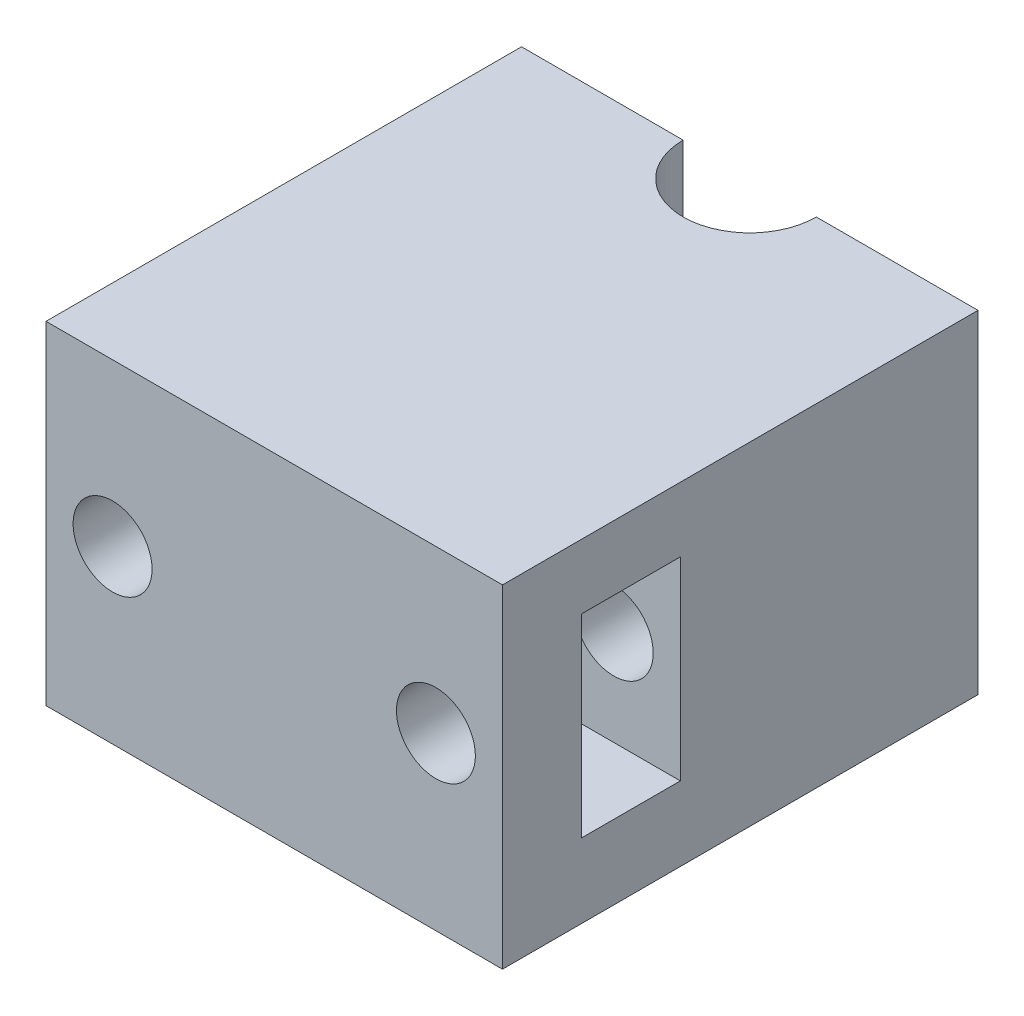
ISO-10303-21;
HEADER;
FILE_DESCRIPTION(('STEP AP214'),'2;1');
FILE_NAME('part.step','',(''),(''),'','','');
FILE_SCHEMA(('AUTOMOTIVE_DESIGN { 1 0 10303 214 1 1 1 1 }'));
ENDSEC;
DATA;
#1=APPLICATION_CONTEXT('core data for automotive mechanical design processes');
#2=APPLICATION_PROTOCOL_DEFINITION('international standard','automotive_design',2000,#1);
#3=PRODUCT_CONTEXT('',#1,'mechanical');
#4=PRODUCT('Part','Part','',(#3));
#5=PRODUCT_RELATED_PRODUCT_CATEGORY('part','',(#4));
#6=PRODUCT_DEFINITION_FORMATION('','',#4);
#7=PRODUCT_DEFINITION_CONTEXT('part definition',#1,'design');
#8=PRODUCT_DEFINITION('design','',#6,#7);
#9=PRODUCT_DEFINITION_SHAPE('','',#8);
#10=(LENGTH_UNIT() NAMED_UNIT(*) SI_UNIT(.MILLI.,.METRE.));
#11=(NAMED_UNIT(*) PLANE_ANGLE_UNIT() SI_UNIT($,.RADIAN.));
#12=(NAMED_UNIT(*) SI_UNIT($,.STERADIAN.) SOLID_ANGLE_UNIT());
#13=UNCERTAINTY_MEASURE_WITH_UNIT(LENGTH_MEASURE(1.E-05),#10,'distance_accuracy_value','');
#14=(GEOMETRIC_REPRESENTATION_CONTEXT(3) GLOBAL_UNCERTAINTY_ASSIGNED_CONTEXT((#13)) GLOBAL_UNIT_ASSIGNED_CONTEXT((#10,
#11,#12)) REPRESENTATION_CONTEXT('',''));
#15=CARTESIAN_POINT('',(0.,0.,0.));
#16=DIRECTION('',(0.,0.,1.));
#17=DIRECTION('',(1.,0.,0.));
#18=AXIS2_PLACEMENT_3D('',#15,#16,#17);
#19=CARTESIAN_POINT('',(24.,70.,-25.));
#20=DIRECTION('',(0.,0.,1.));
#21=DIRECTION('',(1.,0.,0.));
#22=AXIS2_PLACEMENT_3D('',#19,#20,#21);
#23=PLANE('',#22);
#24=CARTESIAN_POINT('',(-17.,53.,-25.));
#25=DIRECTION('',(0.,0.,1.));
#26=DIRECTION('',(1.,0.,0.));
#27=AXIS2_PLACEMENT_3D('',#24,#25,#26);
#28=CIRCLE('',#27,4.15);
#29=CARTESIAN_POINT('',(-12.85,53.,-25.));
#30=VERTEX_POINT('',#29);
#31=EDGE_CURVE('E176',#30,#30,#28,.T.);
#32=ORIENTED_EDGE('',*,*,#31,.T.);
#33=EDGE_LOOP('',(#32));
#34=FACE_BOUND('',#33,.T.);
#35=DIRECTION('',(0.,-1.,0.));
#36=VECTOR('',#35,1.);
#37=CARTESIAN_POINT('',(-7.,258.004019536029,-25.));
#38=LINE('',#37,#36);
#39=CARTESIAN_POINT('',(-7.,70.,-25.));
#40=VERTEX_POINT('',#39);
#41=CARTESIAN_POINT('',(-7.,35.0000000000001,-25.));
#42=VERTEX_POINT('',#41);
#43=EDGE_CURVE('E234',#40,#42,#38,.T.);
#44=ORIENTED_EDGE('',*,*,#43,.T.);
#45=DIRECTION('',(1.,0.,0.));
#46=VECTOR('',#45,1.);
#47=CARTESIAN_POINT('',(-24.,35.,-25.));
#48=LINE('',#47,#46);
#49=CARTESIAN_POINT('',(-24.,35.,-25.));
#50=VERTEX_POINT('',#49);
#51=EDGE_CURVE('E51',#50,#42,#48,.T.);
#52=ORIENTED_EDGE('',*,*,#51,.F.);
#53=DIRECTION('',(0.,-1.,0.));
#54=VECTOR('',#53,1.);
#55=CARTESIAN_POINT('',(-24.,70.,-25.));
#56=LINE('',#55,#54);
#57=CARTESIAN_POINT('',(-24.,70.,-25.));
#58=VERTEX_POINT('',#57);
#59=EDGE_CURVE('E152',#58,#50,#56,.T.);
#60=ORIENTED_EDGE('',*,*,#59,.F.);
#61=DIRECTION('',(-1.,0.,0.));
#62=VECTOR('',#61,1.);
#63=CARTESIAN_POINT('',(24.,70.,-25.));
#64=LINE('',#63,#62);
#65=EDGE_CURVE('E225',#40,#58,#64,.T.);
#66=ORIENTED_EDGE('',*,*,#65,.F.);
#67=EDGE_LOOP('',(#44,#52,#60,#66));
#68=FACE_BOUND('',#67,.T.);
#69=ADVANCED_FACE('F37',(#34,#68),#23,.F.);
#70=CARTESIAN_POINT('',(17.,53.,-25.));
#71=DIRECTION('',(0.,0.,1.));
#72=DIRECTION('',(1.,0.,0.));
#73=AXIS2_PLACEMENT_3D('',#70,#71,#72);
#74=CIRCLE('',#73,4.15);
#75=CARTESIAN_POINT('',(21.15,53.,-25.));
#76=VERTEX_POINT('',#75);
#77=EDGE_CURVE('E160',#76,#76,#74,.T.);
#78=ORIENTED_EDGE('',*,*,#77,.T.);
#79=EDGE_LOOP('',(#78));
#80=FACE_BOUND('',#79,.T.);
#81=DIRECTION('',(0.,-1.,0.));
#82=VECTOR('',#81,1.);
#83=CARTESIAN_POINT('',(24.,70.,-25.));
#84=LINE('',#83,#82);
#85=CARTESIAN_POINT('',(24.,70.,-25.));
#86=VERTEX_POINT('',#85);
#87=CARTESIAN_POINT('',(24.,35.,-25.));
#88=VERTEX_POINT('',#87);
#89=EDGE_CURVE('E148',#86,#88,#84,.T.);
#90=ORIENTED_EDGE('',*,*,#89,.T.);
#91=CARTESIAN_POINT('',(7.,35.,-25.));
#92=VERTEX_POINT('',#91);
#93=EDGE_CURVE('E130',#92,#88,#48,.T.);
#94=ORIENTED_EDGE('',*,*,#93,.F.);
#95=DIRECTION('',(0.,-1.,0.));
#96=VECTOR('',#95,1.);
#97=CARTESIAN_POINT('',(7.,258.004019536029,-25.));
#98=LINE('',#97,#96);
#99=CARTESIAN_POINT('',(7.,70.,-25.));
#100=VERTEX_POINT('',#99);
#101=EDGE_CURVE('E236',#100,#92,#98,.T.);
#102=ORIENTED_EDGE('',*,*,#101,.F.);
#103=EDGE_CURVE('E226',#86,#100,#64,.T.);
#104=ORIENTED_EDGE('',*,*,#103,.F.);
#105=EDGE_LOOP('',(#90,#94,#102,#104));
#106=FACE_BOUND('',#105,.T.);
#107=ADVANCED_FACE('F244',(#80,#106),#23,.F.);
#108=CARTESIAN_POINT('',(0.,70.,0.));
#109=DIRECTION('',(0.,1.,0.));
#110=DIRECTION('',(0.,0.,1.));
#111=AXIS2_PLACEMENT_3D('',#108,#109,#110);
#112=PLANE('',#111);
#113=ORIENTED_EDGE('',*,*,#103,.T.);
#114=CARTESIAN_POINT('',(0.,70.,-25.));
#115=DIRECTION('',(0.,1.,0.));
#116=DIRECTION('',(0.,0.,1.));
#117=AXIS2_PLACEMENT_3D('',#114,#115,#116);
#118=CIRCLE('',#117,7.);
#119=EDGE_CURVE('E59',#100,#40,#118,.F.);
#120=ORIENTED_EDGE('',*,*,#119,.T.);
#121=ORIENTED_EDGE('',*,*,#65,.T.);
#122=DIRECTION('',(0.,0.,1.));
#123=VECTOR('',#122,1.);
#124=CARTESIAN_POINT('',(-24.,70.,25.));
#125=LINE('',#124,#123);
#126=CARTESIAN_POINT('',(-24.,70.,25.));
#127=VERTEX_POINT('',#126);
#128=EDGE_CURVE('E219',#58,#127,#125,.T.);
#129=ORIENTED_EDGE('',*,*,#128,.T.);
#130=DIRECTION('',(1.,0.,0.));
#131=VECTOR('',#130,1.);
#132=CARTESIAN_POINT('',(24.,70.,25.));
#133=LINE('',#132,#131);
#134=CARTESIAN_POINT('',(24.,70.,25.));
#135=VERTEX_POINT('',#134);
#136=EDGE_CURVE('E222',#127,#135,#133,.T.);
#137=ORIENTED_EDGE('',*,*,#136,.T.);
#138=DIRECTION('',(0.,0.,-1.));
#139=VECTOR('',#138,1.);
#140=CARTESIAN_POINT('',(24.,70.,25.));
#141=LINE('',#140,#139);
#142=EDGE_CURVE('E147',#135,#86,#141,.T.);
#143=ORIENTED_EDGE('',*,*,#142,.T.);
#144=EDGE_LOOP('',(#113,#120,#121,#129,#137,#143));
#145=FACE_BOUND('',#144,.T.);
#146=ADVANCED_FACE('F245',(#145),#112,.T.);
#147=CARTESIAN_POINT('',(-21.,70.,25.));
#148=DIRECTION('',(1.,0.,0.));
#149=DIRECTION('',(0.,0.,-1.));
#150=AXIS2_PLACEMENT_3D('',#147,#148,#149);
#151=PLANE('',#150);
#152=DIRECTION('',(0.,0.,1.));
#153=VECTOR('',#152,1.);
#154=CARTESIAN_POINT('',(-21.,54.1056672193749,-25.));
#155=LINE('',#154,#153);
#156=CARTESIAN_POINT('',(-21.,54.1056672193749,6.29999999999999));
#157=VERTEX_POINT('',#156);
#158=CARTESIAN_POINT('',(-21.,54.1056672193749,16.7));
#159=VERTEX_POINT('',#158);
#160=EDGE_CURVE('E45',#157,#159,#155,.T.);
#161=ORIENTED_EDGE('',*,*,#160,.F.);
#162=DIRECTION('',(0.,-1.,0.));
#163=VECTOR('',#162,1.);
#164=CARTESIAN_POINT('',(-21.,42.8,6.29999999999999));
#165=LINE('',#164,#163);
#166=CARTESIAN_POINT('',(-21.,63.2,6.29999999999999));
#167=VERTEX_POINT('',#166);
#168=EDGE_CURVE('E188',#167,#157,#165,.T.);
#169=ORIENTED_EDGE('',*,*,#168,.F.);
#170=DIRECTION('',(0.,0.,-1.));
#171=VECTOR('',#170,1.);
#172=CARTESIAN_POINT('',(-21.,63.2,6.29999999999999));
#173=LINE('',#172,#171);
#174=CARTESIAN_POINT('',(-21.,63.2,16.7));
#175=VERTEX_POINT('',#174);
#176=EDGE_CURVE('E191',#175,#167,#173,.T.);
#177=ORIENTED_EDGE('',*,*,#176,.F.);
#178=DIRECTION('',(0.,1.,0.));
#179=VECTOR('',#178,1.);
#180=CARTESIAN_POINT('',(-21.,42.8,16.7));
#181=LINE('',#180,#179);
#182=EDGE_CURVE('E194',#159,#175,#181,.T.);
#183=ORIENTED_EDGE('',*,*,#182,.F.);
#184=EDGE_LOOP('',(#161,#169,#177,#183));
#185=FACE_BOUND('',#184,.T.);
#186=ADVANCED_FACE('F247',(#185),#151,.T.);
#187=CARTESIAN_POINT('',(-24.,70.,25.));
#188=DIRECTION('',(1.,0.,0.));
#189=DIRECTION('',(0.,0.,-1.));
#190=AXIS2_PLACEMENT_3D('',#187,#188,#189);
#191=PLANE('',#190);
#192=ORIENTED_EDGE('',*,*,#59,.T.);
#193=DIRECTION('',(0.,0.,-1.));
#194=VECTOR('',#193,1.);
#195=CARTESIAN_POINT('',(-24.,35.,-25.));
#196=LINE('',#195,#194);
#197=CARTESIAN_POINT('',(-24.,35.,25.));
#198=VERTEX_POINT('',#197);
#199=EDGE_CURVE('E144',#198,#50,#196,.T.);
#200=ORIENTED_EDGE('',*,*,#199,.F.);
#201=DIRECTION('',(0.,-1.,0.));
#202=VECTOR('',#201,1.);
#203=CARTESIAN_POINT('',(-24.,70.,25.));
#204=LINE('',#203,#202);
#205=EDGE_CURVE('E143',#127,#198,#204,.T.);
#206=ORIENTED_EDGE('',*,*,#205,.F.);
#207=ORIENTED_EDGE('',*,*,#128,.F.);
#208=EDGE_LOOP('',(#192,#200,#206,#207));
#209=FACE_BOUND('',#208,.T.);
#210=ADVANCED_FACE('F39',(#209),#191,.F.);
#211=CARTESIAN_POINT('',(24.,70.,25.));
#212=DIRECTION('',(0.,0.,-1.));
#213=DIRECTION('',(-1.,0.,0.));
#214=AXIS2_PLACEMENT_3D('',#211,#212,#213);
#215=PLANE('',#214);
#216=CARTESIAN_POINT('',(17.,53.,25.));
#217=DIRECTION('',(0.,0.,1.));
#218=DIRECTION('',(1.,0.,0.));
#219=AXIS2_PLACEMENT_3D('',#216,#217,#218);
#220=CIRCLE('',#219,4.15);
#221=CARTESIAN_POINT('',(21.15,53.,25.));
#222=VERTEX_POINT('',#221);
#223=EDGE_CURVE('E167',#222,#222,#220,.T.);
#224=ORIENTED_EDGE('',*,*,#223,.F.);
#225=EDGE_LOOP('',(#224));
#226=FACE_BOUND('',#225,.T.);
#227=CARTESIAN_POINT('',(-17.,53.,25.));
#228=DIRECTION('',(0.,0.,1.));
#229=DIRECTION('',(1.,0.,0.));
#230=AXIS2_PLACEMENT_3D('',#227,#228,#229);
#231=CIRCLE('',#230,4.15);
#232=CARTESIAN_POINT('',(-12.85,53.,25.));
#233=VERTEX_POINT('',#232);
#234=EDGE_CURVE('E164',#233,#233,#231,.T.);
#235=ORIENTED_EDGE('',*,*,#234,.F.);
#236=EDGE_LOOP('',(#235));
#237=FACE_BOUND('',#236,.T.);
#238=ORIENTED_EDGE('',*,*,#205,.T.);
#239=DIRECTION('',(-1.,0.,0.));
#240=VECTOR('',#239,1.);
#241=CARTESIAN_POINT('',(-24.,35.,25.));
#242=LINE('',#241,#240);
#243=CARTESIAN_POINT('',(24.,35.,25.));
#244=VERTEX_POINT('',#243);
#245=EDGE_CURVE('E127',#244,#198,#242,.T.);
#246=ORIENTED_EDGE('',*,*,#245,.F.);
#247=DIRECTION('',(0.,-1.,0.));
#248=VECTOR('',#247,1.);
#249=CARTESIAN_POINT('',(24.,70.,25.));
#250=LINE('',#249,#248);
#251=EDGE_CURVE('E140',#135,#244,#250,.T.);
#252=ORIENTED_EDGE('',*,*,#251,.F.);
#253=ORIENTED_EDGE('',*,*,#136,.F.);
#254=EDGE_LOOP('',(#238,#246,#252,#253));
#255=FACE_BOUND('',#254,.T.);
#256=ADVANCED_FACE('F139',(#226,#237,#255),#215,.F.);
#257=CARTESIAN_POINT('',(24.,70.,25.));
#258=DIRECTION('',(-1.,0.,0.));
#259=DIRECTION('',(0.,0.,1.));
#260=AXIS2_PLACEMENT_3D('',#257,#258,#259);
#261=PLANE('',#260);
#262=DIRECTION('',(0.,0.,-1.));
#263=VECTOR('',#262,1.);
#264=CARTESIAN_POINT('',(24.,42.8,6.29999999999999));
#265=LINE('',#264,#263);
#266=CARTESIAN_POINT('',(24.,42.8,16.7));
#267=VERTEX_POINT('',#266);
#268=CARTESIAN_POINT('',(24.,42.8,6.29999999999999));
#269=VERTEX_POINT('',#268);
#270=EDGE_CURVE('E200',#267,#269,#265,.T.);
#271=ORIENTED_EDGE('',*,*,#270,.F.);
#272=DIRECTION('',(0.,-1.,0.));
#273=VECTOR('',#272,1.);
#274=CARTESIAN_POINT('',(24.,42.8,16.7));
#275=LINE('',#274,#273);
#276=CARTESIAN_POINT('',(24.,63.2,16.7));
#277=VERTEX_POINT('',#276);
#278=EDGE_CURVE('E187',#277,#267,#275,.T.);
#279=ORIENTED_EDGE('',*,*,#278,.F.);
#280=DIRECTION('',(0.,0.,1.));
#281=VECTOR('',#280,1.);
#282=CARTESIAN_POINT('',(24.,63.2,6.29999999999999));
#283=LINE('',#282,#281);
#284=CARTESIAN_POINT('',(24.,63.2,6.29999999999999));
#285=VERTEX_POINT('',#284);
#286=EDGE_CURVE('E206',#285,#277,#283,.T.);
#287=ORIENTED_EDGE('',*,*,#286,.F.);
#288=DIRECTION('',(0.,1.,0.));
#289=VECTOR('',#288,1.);
#290=CARTESIAN_POINT('',(24.,42.8,6.29999999999999));
#291=LINE('',#290,#289);
#292=EDGE_CURVE('E203',#269,#285,#291,.T.);
#293=ORIENTED_EDGE('',*,*,#292,.F.);
#294=EDGE_LOOP('',(#271,#279,#287,#293));
#295=FACE_BOUND('',#294,.T.);
#296=ORIENTED_EDGE('',*,*,#251,.T.);
#297=DIRECTION('',(0.,0.,1.));
#298=VECTOR('',#297,1.);
#299=CARTESIAN_POINT('',(24.,35.,-25.));
#300=LINE('',#299,#298);
#301=EDGE_CURVE('E124',#88,#244,#300,.T.);
#302=ORIENTED_EDGE('',*,*,#301,.F.);
#303=ORIENTED_EDGE('',*,*,#89,.F.);
#304=ORIENTED_EDGE('',*,*,#142,.F.);
#305=EDGE_LOOP('',(#296,#302,#303,#304));
#306=FACE_BOUND('',#305,.T.);
#307=ADVANCED_FACE('F146',(#295,#306),#261,.F.);
#308=CARTESIAN_POINT('',(-46.8980348501787,42.8,16.7));
#309=DIRECTION('',(0.,0.,1.));
#310=DIRECTION('',(1.,0.,0.));
#311=AXIS2_PLACEMENT_3D('',#308,#309,#310);
#312=PLANE('',#311);
#313=CARTESIAN_POINT('',(17.,53.,16.7));
#314=DIRECTION('',(0.,0.,1.));
#315=DIRECTION('',(1.,0.,0.));
#316=AXIS2_PLACEMENT_3D('',#313,#314,#315);
#317=CIRCLE('',#316,4.15);
#318=CARTESIAN_POINT('',(21.15,53.,16.7));
#319=VERTEX_POINT('',#318);
#320=EDGE_CURVE('E159',#319,#319,#317,.T.);
#321=ORIENTED_EDGE('',*,*,#320,.T.);
#322=EDGE_LOOP('',(#321));
#323=FACE_BOUND('',#322,.T.);
#324=CARTESIAN_POINT('',(-21.,42.8,16.7));
#325=VERTEX_POINT('',#324);
#326=CARTESIAN_POINT('',(-21.,51.8943327806251,16.7));
#327=VERTEX_POINT('',#326);
#328=EDGE_CURVE('E195',#325,#327,#181,.T.);
#329=ORIENTED_EDGE('',*,*,#328,.T.);
#330=CARTESIAN_POINT('',(-17.,53.,16.7));
#331=DIRECTION('',(0.,0.,1.));
#332=DIRECTION('',(1.,0.,0.));
#333=AXIS2_PLACEMENT_3D('',#330,#331,#332);
#334=CIRCLE('',#333,4.15);
#335=EDGE_CURVE('E184',#327,#159,#334,.T.);
#336=ORIENTED_EDGE('',*,*,#335,.T.);
#337=ORIENTED_EDGE('',*,*,#182,.T.);
#338=DIRECTION('',(1.,0.,0.));
#339=VECTOR('',#338,1.);
#340=CARTESIAN_POINT('',(-46.8980348501787,63.2,16.7));
#341=LINE('',#340,#339);
#342=EDGE_CURVE('E210',#175,#277,#341,.T.);
#343=ORIENTED_EDGE('',*,*,#342,.T.);
#344=ORIENTED_EDGE('',*,*,#278,.T.);
#345=DIRECTION('',(1.,0.,0.));
#346=VECTOR('',#345,1.);
#347=CARTESIAN_POINT('',(-46.8980348501787,42.8,16.7));
#348=LINE('',#347,#346);
#349=EDGE_CURVE('E209',#325,#267,#348,.T.);
#350=ORIENTED_EDGE('',*,*,#349,.F.);
#351=EDGE_LOOP('',(#329,#336,#337,#343,#344,#350));
#352=FACE_BOUND('',#351,.T.);
#353=ADVANCED_FACE('F265',(#323,#352),#312,.F.);
#354=CARTESIAN_POINT('',(-46.8980348501787,63.2,6.29999999999999));
#355=DIRECTION('',(0.,1.,0.));
#356=DIRECTION('',(0.,0.,1.));
#357=AXIS2_PLACEMENT_3D('',#354,#355,#356);
#358=PLANE('',#357);
#359=ORIENTED_EDGE('',*,*,#176,.T.);
#360=DIRECTION('',(1.,0.,0.));
#361=VECTOR('',#360,1.);
#362=CARTESIAN_POINT('',(-46.8980348501787,63.2,6.29999999999999));
#363=LINE('',#362,#361);
#364=EDGE_CURVE('E212',#167,#285,#363,.T.);
#365=ORIENTED_EDGE('',*,*,#364,.T.);
#366=ORIENTED_EDGE('',*,*,#286,.T.);
#367=ORIENTED_EDGE('',*,*,#342,.F.);
#368=EDGE_LOOP('',(#359,#365,#366,#367));
#369=FACE_BOUND('',#368,.T.);
#370=ADVANCED_FACE('F293',(#369),#358,.F.);
#371=CARTESIAN_POINT('',(-46.8980348501787,42.8,6.29999999999999));
#372=DIRECTION('',(0.,0.,-1.));
#373=DIRECTION('',(0.,1.,0.));
#374=AXIS2_PLACEMENT_3D('',#371,#372,#373);
#375=PLANE('',#374);
#376=CARTESIAN_POINT('',(17.,53.,6.29999999999999));
#377=DIRECTION('',(0.,0.,-1.));
#378=DIRECTION('',(0.,1.,0.));
#379=AXIS2_PLACEMENT_3D('',#376,#377,#378);
#380=CIRCLE('',#379,4.15);
#381=CARTESIAN_POINT('',(17.,57.15,6.29999999999999));
#382=VERTEX_POINT('',#381);
#383=EDGE_CURVE('E157',#382,#382,#380,.T.);
#384=ORIENTED_EDGE('',*,*,#383,.T.);
#385=EDGE_LOOP('',(#384));
#386=FACE_BOUND('',#385,.T.);
#387=ORIENTED_EDGE('',*,*,#168,.T.);
#388=CARTESIAN_POINT('',(-17.,53.,6.29999999999999));
#389=DIRECTION('',(0.,0.,-1.));
#390=DIRECTION('',(0.,1.,0.));
#391=AXIS2_PLACEMENT_3D('',#388,#389,#390);
#392=CIRCLE('',#391,4.15);
#393=CARTESIAN_POINT('',(-21.,51.8943327806251,6.29999999999999));
#394=VERTEX_POINT('',#393);
#395=EDGE_CURVE('E179',#157,#394,#392,.T.);
#396=ORIENTED_EDGE('',*,*,#395,.T.);
#397=CARTESIAN_POINT('',(-21.,42.8,6.29999999999999));
#398=VERTEX_POINT('',#397);
#399=EDGE_CURVE('E192',#394,#398,#165,.T.);
#400=ORIENTED_EDGE('',*,*,#399,.T.);
#401=DIRECTION('',(1.,0.,0.));
#402=VECTOR('',#401,1.);
#403=CARTESIAN_POINT('',(-46.8980348501787,42.8,6.29999999999999));
#404=LINE('',#403,#402);
#405=EDGE_CURVE('E214',#398,#269,#404,.T.);
#406=ORIENTED_EDGE('',*,*,#405,.T.);
#407=ORIENTED_EDGE('',*,*,#292,.T.);
#408=ORIENTED_EDGE('',*,*,#364,.F.);
#409=EDGE_LOOP('',(#387,#396,#400,#406,#407,#408));
#410=FACE_BOUND('',#409,.T.);
#411=ADVANCED_FACE('F296',(#386,#410),#375,.F.);
#412=CARTESIAN_POINT('',(-46.8980348501787,42.8,6.29999999999999));
#413=DIRECTION('',(0.,-1.,0.));
#414=DIRECTION('',(0.,0.,-1.));
#415=AXIS2_PLACEMENT_3D('',#412,#413,#414);
#416=PLANE('',#415);
#417=DIRECTION('',(0.,0.,1.));
#418=VECTOR('',#417,1.);
#419=CARTESIAN_POINT('',(-21.,42.8,6.29999999999999));
#420=LINE('',#419,#418);
#421=EDGE_CURVE('E198',#398,#325,#420,.T.);
#422=ORIENTED_EDGE('',*,*,#421,.T.);
#423=ORIENTED_EDGE('',*,*,#349,.T.);
#424=ORIENTED_EDGE('',*,*,#270,.T.);
#425=ORIENTED_EDGE('',*,*,#405,.F.);
#426=EDGE_LOOP('',(#422,#423,#424,#425));
#427=FACE_BOUND('',#426,.T.);
#428=ADVANCED_FACE('F288',(#427),#416,.F.);
#429=DIRECTION('',(0.,0.,1.));
#430=VECTOR('',#429,1.);
#431=CARTESIAN_POINT('',(-21.,51.8943327806251,-25.));
#432=LINE('',#431,#430);
#433=EDGE_CURVE('E150',#327,#394,#432,.F.);
#434=ORIENTED_EDGE('',*,*,#433,.F.);
#435=ORIENTED_EDGE('',*,*,#328,.F.);
#436=ORIENTED_EDGE('',*,*,#421,.F.);
#437=ORIENTED_EDGE('',*,*,#399,.F.);
#438=EDGE_LOOP('',(#434,#435,#436,#437));
#439=FACE_BOUND('',#438,.T.);
#440=ADVANCED_FACE('F255',(#439),#151,.T.);
#441=CARTESIAN_POINT('',(-17.,53.,-25.));
#442=DIRECTION('',(0.,0.,1.));
#443=DIRECTION('',(1.,0.,0.));
#444=AXIS2_PLACEMENT_3D('',#441,#442,#443);
#445=CYLINDRICAL_SURFACE('',#444,4.15);
#446=ORIENTED_EDGE('',*,*,#160,.T.);
#447=ORIENTED_EDGE('',*,*,#335,.F.);
#448=ORIENTED_EDGE('',*,*,#433,.T.);
#449=ORIENTED_EDGE('',*,*,#395,.F.);
#450=EDGE_LOOP('',(#446,#447,#448,#449));
#451=FACE_BOUND('',#450,.T.);
#452=ORIENTED_EDGE('',*,*,#31,.F.);
#453=EDGE_LOOP('',(#452));
#454=FACE_BOUND('',#453,.T.);
#455=ORIENTED_EDGE('',*,*,#234,.T.);
#456=EDGE_LOOP('',(#455));
#457=FACE_BOUND('',#456,.T.);
#458=ADVANCED_FACE('F276',(#451,#454,#457),#445,.F.);
#459=CARTESIAN_POINT('',(17.,53.,-25.));
#460=DIRECTION('',(0.,0.,1.));
#461=DIRECTION('',(1.,0.,0.));
#462=AXIS2_PLACEMENT_3D('',#459,#460,#461);
#463=CYLINDRICAL_SURFACE('',#462,4.15);
#464=ORIENTED_EDGE('',*,*,#77,.F.);
#465=EDGE_LOOP('',(#464));
#466=FACE_BOUND('',#465,.T.);
#467=ORIENTED_EDGE('',*,*,#383,.F.);
#468=EDGE_LOOP('',(#467));
#469=FACE_BOUND('',#468,.T.);
#470=ADVANCED_FACE('F278',(#466,#469),#463,.F.);
#471=ORIENTED_EDGE('',*,*,#223,.T.);
#472=EDGE_LOOP('',(#471));
#473=FACE_BOUND('',#472,.T.);
#474=ORIENTED_EDGE('',*,*,#320,.F.);
#475=EDGE_LOOP('',(#474));
#476=FACE_BOUND('',#475,.T.);
#477=ADVANCED_FACE('F285',(#473,#476),#463,.F.);
#478=CARTESIAN_POINT('',(0.,258.004019536029,-25.));
#479=DIRECTION('',(0.,-1.,0.));
#480=DIRECTION('',(0.,0.,-1.));
#481=AXIS2_PLACEMENT_3D('',#478,#479,#480);
#482=CYLINDRICAL_SURFACE('',#481,7.);
#483=CARTESIAN_POINT('',(0.,35.,-25.));
#484=DIRECTION('',(0.,1.,0.));
#485=DIRECTION('',(0.,0.,1.));
#486=AXIS2_PLACEMENT_3D('',#483,#484,#485);
#487=CIRCLE('',#486,7.);
#488=EDGE_CURVE('E12',#42,#92,#487,.T.);
#489=ORIENTED_EDGE('',*,*,#488,.F.);
#490=ORIENTED_EDGE('',*,*,#43,.F.);
#491=ORIENTED_EDGE('',*,*,#119,.F.);
#492=ORIENTED_EDGE('',*,*,#101,.T.);
#493=EDGE_LOOP('',(#489,#490,#491,#492));
#494=FACE_BOUND('',#493,.T.);
#495=ADVANCED_FACE('F241',(#494),#482,.F.);
#496=CARTESIAN_POINT('',(0.,35.,0.));
#497=DIRECTION('',(0.,1.,0.));
#498=DIRECTION('',(0.,0.,1.));
#499=AXIS2_PLACEMENT_3D('',#496,#497,#498);
#500=PLANE('',#499);
#501=ORIENTED_EDGE('',*,*,#488,.T.);
#502=ORIENTED_EDGE('',*,*,#93,.T.);
#503=ORIENTED_EDGE('',*,*,#301,.T.);
#504=ORIENTED_EDGE('',*,*,#245,.T.);
#505=ORIENTED_EDGE('',*,*,#199,.T.);
#506=ORIENTED_EDGE('',*,*,#51,.T.);
#507=EDGE_LOOP('',(#501,#502,#503,#504,#505,#506));
#508=FACE_BOUND('',#507,.T.);
#509=ADVANCED_FACE('F126',(#508),#500,.F.);
#510=CLOSED_SHELL('',(#69,#107,#146,#186,#210,#256,#307,#353,#370,#411,#428,#440,#458,#470,#477,
#495,#509));
#511=MANIFOLD_SOLID_BREP('B2',#510);
#512=ADVANCED_BREP_SHAPE_REPRESENTATION('',(#18,#511),#14);
#513=SHAPE_DEFINITION_REPRESENTATION(#9,#512);
ENDSEC;
END-ISO-10303-21;
